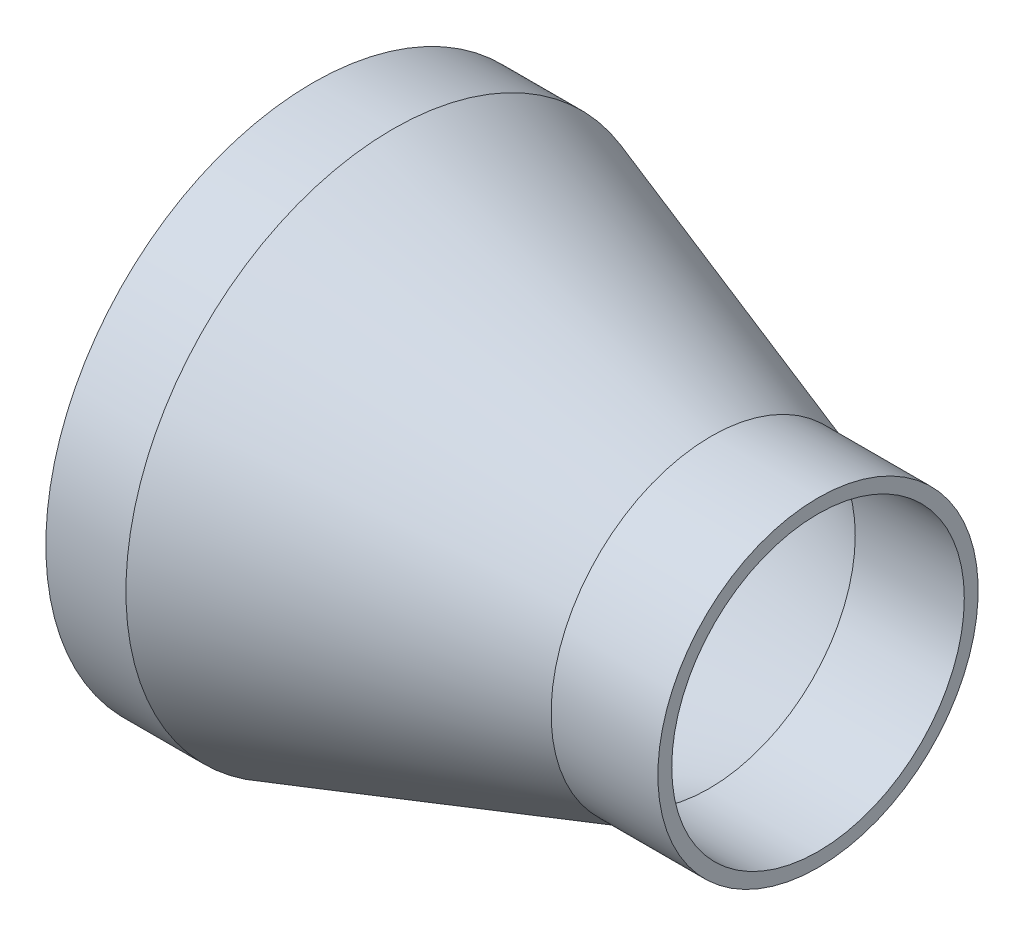
ISO-10303-21;
HEADER;
FILE_DESCRIPTION(('STEP AP214'),'2;1');
FILE_NAME('part.step','',(''),(''),'','','');
FILE_SCHEMA(('AUTOMOTIVE_DESIGN { 1 0 10303 214 1 1 1 1 }'));
ENDSEC;
DATA;
#1=APPLICATION_CONTEXT('core data for automotive mechanical design processes');
#2=APPLICATION_PROTOCOL_DEFINITION('international standard','automotive_design',2000,#1);
#3=PRODUCT_CONTEXT('',#1,'mechanical');
#4=PRODUCT('Part','Part','',(#3));
#5=PRODUCT_RELATED_PRODUCT_CATEGORY('part','',(#4));
#6=PRODUCT_DEFINITION_FORMATION('','',#4);
#7=PRODUCT_DEFINITION_CONTEXT('part definition',#1,'design');
#8=PRODUCT_DEFINITION('design','',#6,#7);
#9=PRODUCT_DEFINITION_SHAPE('','',#8);
#10=(LENGTH_UNIT() NAMED_UNIT(*) SI_UNIT(.MILLI.,.METRE.));
#11=(NAMED_UNIT(*) PLANE_ANGLE_UNIT() SI_UNIT($,.RADIAN.));
#12=(NAMED_UNIT(*) SI_UNIT($,.STERADIAN.) SOLID_ANGLE_UNIT());
#13=UNCERTAINTY_MEASURE_WITH_UNIT(LENGTH_MEASURE(1.E-05),#10,'distance_accuracy_value','');
#14=(GEOMETRIC_REPRESENTATION_CONTEXT(3) GLOBAL_UNCERTAINTY_ASSIGNED_CONTEXT((#13)) GLOBAL_UNIT_ASSIGNED_CONTEXT((#10,
#11,#12)) REPRESENTATION_CONTEXT('',''));
#15=CARTESIAN_POINT('',(0.,0.,0.));
#16=DIRECTION('',(0.,0.,1.));
#17=DIRECTION('',(1.,0.,0.));
#18=AXIS2_PLACEMENT_3D('',#15,#16,#17);
#19=CARTESIAN_POINT('',(9.25554604716234,0.,0.));
#20=DIRECTION('',(-1.,0.,0.));
#21=DIRECTION('',(0.,-1.,0.));
#22=AXIS2_PLACEMENT_3D('',#19,#20,#21);
#23=CONICAL_SURFACE('',#22,30.0989999929991,0.323560324824038);
#24=CARTESIAN_POINT('',(47.1269460495131,0.,0.));
#25=DIRECTION('',(1.,0.,0.));
#26=DIRECTION('',(0.,1.,0.));
#27=AXIS2_PLACEMENT_3D('',#24,#25,#26);
#28=CIRCLE('',#27,17.399);
#29=CARTESIAN_POINT('',(47.1269460495131,17.399,0.));
#30=VERTEX_POINT('',#29);
#31=EDGE_CURVE('E37',#30,#30,#28,.T.);
#32=ORIENTED_EDGE('',*,*,#31,.T.);
#33=EDGE_LOOP('',(#32));
#34=FACE_BOUND('',#33,.T.);
#35=CARTESIAN_POINT('',(9.2555460495101,0.,0.));
#36=DIRECTION('',(1.,0.,0.));
#37=DIRECTION('',(0.,1.,0.));
#38=AXIS2_PLACEMENT_3D('',#35,#36,#37);
#39=CIRCLE('',#38,30.099);
#40=CARTESIAN_POINT('',(9.2555460495101,30.099,0.));
#41=VERTEX_POINT('',#40);
#42=EDGE_CURVE('E34',#41,#41,#39,.F.);
#43=ORIENTED_EDGE('',*,*,#42,.T.);
#44=EDGE_LOOP('',(#43));
#45=FACE_BOUND('',#44,.T.);
#46=ADVANCED_FACE('F15',(#34,#45),#23,.F.);
#47=CARTESIAN_POINT('',(53.6116730247583,0.,0.));
#48=DIRECTION('',(1.,0.,0.));
#49=DIRECTION('',(0.,1.,0.));
#50=AXIS2_PLACEMENT_3D('',#47,#48,#49);
#51=CYLINDRICAL_SURFACE('',#50,17.399);
#52=CARTESIAN_POINT('',(60.0964000000034,0.,0.));
#53=DIRECTION('',(1.,0.,0.));
#54=DIRECTION('',(0.,1.,0.));
#55=AXIS2_PLACEMENT_3D('',#52,#53,#54);
#56=CIRCLE('',#55,17.399);
#57=CARTESIAN_POINT('',(60.0964000000034,17.399,0.));
#58=VERTEX_POINT('',#57);
#59=EDGE_CURVE('E18',#58,#58,#56,.F.);
#60=ORIENTED_EDGE('',*,*,#59,.F.);
#61=EDGE_LOOP('',(#60));
#62=FACE_BOUND('',#61,.T.);
#63=ORIENTED_EDGE('',*,*,#31,.F.);
#64=EDGE_LOOP('',(#63));
#65=FACE_BOUND('',#64,.T.);
#66=ADVANCED_FACE('F58',(#62,#65),#51,.F.);
#67=CARTESIAN_POINT('',(4.62777302475505,0.,0.));
#68=DIRECTION('',(1.,0.,0.));
#69=DIRECTION('',(0.,1.,0.));
#70=AXIS2_PLACEMENT_3D('',#67,#68,#69);
#71=CYLINDRICAL_SURFACE('',#70,30.099);
#72=ORIENTED_EDGE('',*,*,#42,.F.);
#73=EDGE_LOOP('',(#72));
#74=FACE_BOUND('',#73,.T.);
#75=CARTESIAN_POINT('',(0.,0.,0.));
#76=DIRECTION('',(1.,0.,0.));
#77=DIRECTION('',(0.,1.,0.));
#78=AXIS2_PLACEMENT_3D('',#75,#76,#77);
#79=CIRCLE('',#78,30.099);
#80=CARTESIAN_POINT('',(0.,30.099,0.));
#81=VERTEX_POINT('',#80);
#82=EDGE_CURVE('E48',#81,#81,#79,.T.);
#83=ORIENTED_EDGE('',*,*,#82,.F.);
#84=EDGE_LOOP('',(#83));
#85=FACE_BOUND('',#84,.T.);
#86=ADVANCED_FACE('F61',(#74,#85),#71,.F.);
#87=CARTESIAN_POINT('',(60.0964000000034,18.2245,0.));
#88=DIRECTION('',(1.,0.,0.));
#89=DIRECTION('',(0.,0.,-1.));
#90=AXIS2_PLACEMENT_3D('',#87,#88,#89);
#91=PLANE('',#90);
#92=ORIENTED_EDGE('',*,*,#59,.T.);
#93=EDGE_LOOP('',(#92));
#94=FACE_BOUND('',#93,.T.);
#95=CARTESIAN_POINT('',(60.0964000000034,0.,0.));
#96=DIRECTION('',(1.,0.,0.));
#97=DIRECTION('',(0.,1.,0.));
#98=AXIS2_PLACEMENT_3D('',#95,#96,#97);
#99=CIRCLE('',#98,19.05);
#100=CARTESIAN_POINT('',(60.0964000000034,19.05,0.));
#101=VERTEX_POINT('',#100);
#102=EDGE_CURVE('E46',#101,#101,#99,.F.);
#103=ORIENTED_EDGE('',*,*,#102,.F.);
#104=EDGE_LOOP('',(#103));
#105=FACE_BOUND('',#104,.T.);
#106=ADVANCED_FACE('F55',(#94,#105),#91,.T.);
#107=CARTESIAN_POINT('',(0.,30.9245,0.));
#108=DIRECTION('',(-1.,0.,0.));
#109=DIRECTION('',(0.,0.,1.));
#110=AXIS2_PLACEMENT_3D('',#107,#108,#109);
#111=PLANE('',#110);
#112=ORIENTED_EDGE('',*,*,#82,.T.);
#113=EDGE_LOOP('',(#112));
#114=FACE_BOUND('',#113,.T.);
#115=CARTESIAN_POINT('',(0.,0.,0.));
#116=DIRECTION('',(1.,0.,0.));
#117=DIRECTION('',(0.,1.,0.));
#118=AXIS2_PLACEMENT_3D('',#115,#116,#117);
#119=CIRCLE('',#118,31.75);
#120=CARTESIAN_POINT('',(0.,31.75,0.));
#121=VERTEX_POINT('',#120);
#122=EDGE_CURVE('E27',#121,#121,#119,.T.);
#123=ORIENTED_EDGE('',*,*,#122,.F.);
#124=EDGE_LOOP('',(#123));
#125=FACE_BOUND('',#124,.T.);
#126=ADVANCED_FACE('F75',(#114,#125),#111,.T.);
#127=CARTESIAN_POINT('',(53.7464000000034,0.,0.));
#128=DIRECTION('',(1.,0.,0.));
#129=DIRECTION('',(0.,1.,0.));
#130=AXIS2_PLACEMENT_3D('',#127,#128,#129);
#131=CYLINDRICAL_SURFACE('',#130,19.05);
#132=CARTESIAN_POINT('',(47.3964000023511,0.,0.));
#133=DIRECTION('',(-1.,0.,0.));
#134=DIRECTION('',(0.,1.,0.));
#135=AXIS2_PLACEMENT_3D('',#132,#133,#134);
#136=CIRCLE('',#135,19.050000007001);
#137=CARTESIAN_POINT('',(47.3964000023511,19.050000007001,0.));
#138=VERTEX_POINT('',#137);
#139=EDGE_CURVE('E22',#138,#138,#136,.T.);
#140=ORIENTED_EDGE('',*,*,#139,.F.);
#141=EDGE_LOOP('',(#140));
#142=FACE_BOUND('',#141,.T.);
#143=ORIENTED_EDGE('',*,*,#102,.T.);
#144=EDGE_LOOP('',(#143));
#145=FACE_BOUND('',#144,.T.);
#146=ADVANCED_FACE('F84',(#142,#145),#131,.T.);
#147=CARTESIAN_POINT('',(4.76250000000018,0.,0.));
#148=DIRECTION('',(1.,0.,0.));
#149=DIRECTION('',(0.,1.,0.));
#150=AXIS2_PLACEMENT_3D('',#147,#148,#149);
#151=CYLINDRICAL_SURFACE('',#150,31.75);
#152=ORIENTED_EDGE('',*,*,#122,.T.);
#153=EDGE_LOOP('',(#152));
#154=FACE_BOUND('',#153,.T.);
#155=CARTESIAN_POINT('',(9.52499999765262,0.,0.));
#156=DIRECTION('',(-1.,0.,0.));
#157=DIRECTION('',(0.,1.,0.));
#158=AXIS2_PLACEMENT_3D('',#155,#156,#157);
#159=CIRCLE('',#158,31.7499999929991);
#160=CARTESIAN_POINT('',(9.52499999765262,31.7499999929991,0.));
#161=VERTEX_POINT('',#160);
#162=EDGE_CURVE('E10',#161,#161,#159,.F.);
#163=ORIENTED_EDGE('',*,*,#162,.F.);
#164=EDGE_LOOP('',(#163));
#165=FACE_BOUND('',#164,.T.);
#166=ADVANCED_FACE('F79',(#154,#165),#151,.T.);
#167=CARTESIAN_POINT('',(9.52499999765262,0.,0.));
#168=DIRECTION('',(-1.,0.,0.));
#169=DIRECTION('',(0.,-1.,0.));
#170=AXIS2_PLACEMENT_3D('',#167,#168,#169);
#171=CONICAL_SURFACE('',#170,31.7499999929991,0.323560324824038);
#172=ORIENTED_EDGE('',*,*,#162,.T.);
#173=EDGE_LOOP('',(#172));
#174=FACE_BOUND('',#173,.T.);
#175=ORIENTED_EDGE('',*,*,#139,.T.);
#176=EDGE_LOOP('',(#175));
#177=FACE_BOUND('',#176,.T.);
#178=ADVANCED_FACE('F77',(#174,#177),#171,.T.);
#179=CLOSED_SHELL('',(#46,#66,#86,#106,#126,#146,#166,#178));
#180=MANIFOLD_SOLID_BREP('B1',#179);
#181=ADVANCED_BREP_SHAPE_REPRESENTATION('',(#18,#180),#14);
#182=SHAPE_DEFINITION_REPRESENTATION(#9,#181);
ENDSEC;
END-ISO-10303-21;
